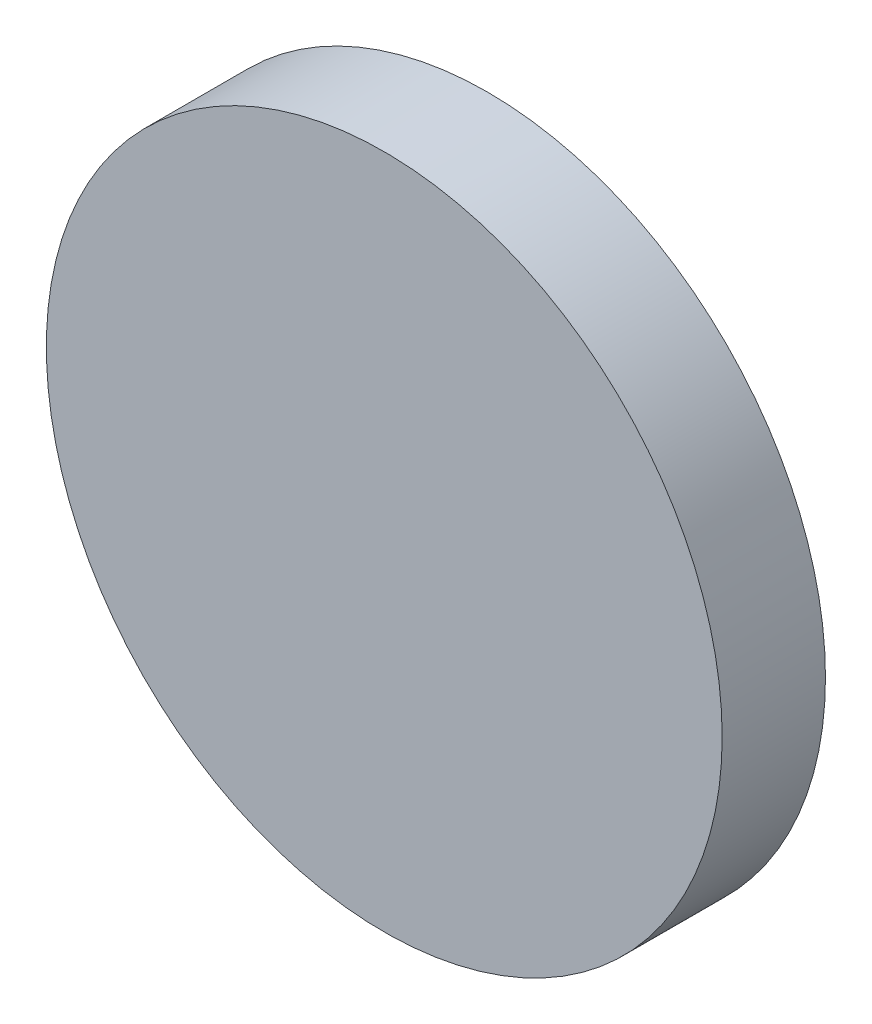
ISO-10303-21;
HEADER;
FILE_DESCRIPTION(('STEP AP214'),'2;1');
FILE_NAME('part.step','',(''),(''),'','','');
FILE_SCHEMA(('AUTOMOTIVE_DESIGN { 1 0 10303 214 1 1 1 1 }'));
ENDSEC;
DATA;
#1=APPLICATION_CONTEXT('core data for automotive mechanical design processes');
#2=APPLICATION_PROTOCOL_DEFINITION('international standard','automotive_design',2000,#1);
#3=PRODUCT_CONTEXT('',#1,'mechanical');
#4=PRODUCT('Part','Part','',(#3));
#5=PRODUCT_RELATED_PRODUCT_CATEGORY('part','',(#4));
#6=PRODUCT_DEFINITION_FORMATION('','',#4);
#7=PRODUCT_DEFINITION_CONTEXT('part definition',#1,'design');
#8=PRODUCT_DEFINITION('design','',#6,#7);
#9=PRODUCT_DEFINITION_SHAPE('','',#8);
#10=(LENGTH_UNIT() NAMED_UNIT(*) SI_UNIT(.MILLI.,.METRE.));
#11=(NAMED_UNIT(*) PLANE_ANGLE_UNIT() SI_UNIT($,.RADIAN.));
#12=(NAMED_UNIT(*) SI_UNIT($,.STERADIAN.) SOLID_ANGLE_UNIT());
#13=UNCERTAINTY_MEASURE_WITH_UNIT(LENGTH_MEASURE(1.E-05),#10,'distance_accuracy_value','');
#14=(GEOMETRIC_REPRESENTATION_CONTEXT(3) GLOBAL_UNCERTAINTY_ASSIGNED_CONTEXT((#13)) GLOBAL_UNIT_ASSIGNED_CONTEXT((#10,
#11,#12)) REPRESENTATION_CONTEXT('',''));
#15=CARTESIAN_POINT('',(0.,0.,0.));
#16=DIRECTION('',(0.,0.,1.));
#17=DIRECTION('',(1.,0.,0.));
#18=AXIS2_PLACEMENT_3D('',#15,#16,#17);
#19=CARTESIAN_POINT('',(0.,26.112,5.));
#20=DIRECTION('',(0.,0.,1.));
#21=DIRECTION('',(1.,0.,0.));
#22=AXIS2_PLACEMENT_3D('',#19,#20,#21);
#23=PLANE('',#22);
#24=CARTESIAN_POINT('',(0.,0.,5.));
#25=DIRECTION('',(0.,0.,1.));
#26=DIRECTION('',(1.,0.,0.));
#27=AXIS2_PLACEMENT_3D('',#24,#25,#26);
#28=CIRCLE('',#27,12.7);
#29=CARTESIAN_POINT('',(12.7,0.,5.));
#30=VERTEX_POINT('',#29);
#31=EDGE_CURVE('E19',#30,#30,#28,.F.);
#32=ORIENTED_EDGE('',*,*,#31,.F.);
#33=EDGE_LOOP('',(#32));
#34=FACE_BOUND('',#33,.T.);
#35=ADVANCED_FACE('F16',(#34),#23,.T.);
#36=CARTESIAN_POINT('',(0.,0.,1.11817791011397));
#37=DIRECTION('',(0.,0.,1.));
#38=DIRECTION('',(1.,0.,0.));
#39=AXIS2_PLACEMENT_3D('',#36,#37,#38);
#40=CYLINDRICAL_SURFACE('',#39,12.7);
#41=ORIENTED_EDGE('',*,*,#31,.T.);
#42=EDGE_LOOP('',(#41));
#43=FACE_BOUND('',#42,.T.);
#44=CARTESIAN_POINT('',(0.,0.,1.11817791011397));
#45=DIRECTION('',(0.,0.,-1.));
#46=DIRECTION('',(-1.,0.,0.));
#47=AXIS2_PLACEMENT_3D('',#44,#45,#46);
#48=CIRCLE('',#47,12.7);
#49=CARTESIAN_POINT('',(-12.7,0.,1.11817791011397));
#50=VERTEX_POINT('',#49);
#51=EDGE_CURVE('E10',#50,#50,#48,.T.);
#52=ORIENTED_EDGE('',*,*,#51,.F.);
#53=EDGE_LOOP('',(#52));
#54=FACE_BOUND('',#53,.T.);
#55=ADVANCED_FACE('F27',(#43,#54),#40,.T.);
#56=CARTESIAN_POINT('',(0.,12.7,1.11817791011397));
#57=CARTESIAN_POINT('',(-12.7,12.7,1.11817791011397));
#58=CARTESIAN_POINT('',(-12.7,0.,1.11817791011397));
#59=CARTESIAN_POINT('',(-12.7,-12.7,1.11817791011397));
#60=CARTESIAN_POINT('',(0.,-12.7,1.11817791011397));
#61=CARTESIAN_POINT('',(12.7,-12.7,1.11817791011397));
#62=CARTESIAN_POINT('',(12.7,0.,1.11817791011397));
#63=CARTESIAN_POINT('',(12.7,12.7,1.11817791011397));
#64=CARTESIAN_POINT('',(0.,12.7,1.11817791011397));
#65=CARTESIAN_POINT('',(0.,11.4702107915972,0.903018483802192));
#66=CARTESIAN_POINT('',(-11.4702107915972,11.4702107915972,0.903018483802192));
#67=CARTESIAN_POINT('',(-11.4702107915972,0.,0.903018483802192));
#68=CARTESIAN_POINT('',(-11.4702107915972,-11.4702107915972,0.903018483802192));
#69=CARTESIAN_POINT('',(0.,-11.4702107915972,0.903018483802192));
#70=CARTESIAN_POINT('',(11.4702107915972,-11.4702107915972,0.903018483802192));
#71=CARTESIAN_POINT('',(11.4702107915972,0.,0.903018483802192));
#72=CARTESIAN_POINT('',(11.4702107915972,11.4702107915972,0.903018483802192));
#73=CARTESIAN_POINT('',(0.,11.4702107915972,0.903018483802192));
#74=CARTESIAN_POINT('',(0.,9.70837581055734,0.638258659520624));
#75=CARTESIAN_POINT('',(-9.70837581055734,9.70837581055734,0.638258659520624));
#76=CARTESIAN_POINT('',(-9.70837581055734,0.,0.638258659520624));
#77=CARTESIAN_POINT('',(-9.70837581055734,-9.70837581055734,0.638258659520624));
#78=CARTESIAN_POINT('',(0.,-9.70837581055734,0.638258659520624));
#79=CARTESIAN_POINT('',(9.70837581055734,-9.70837581055734,0.638258659520624));
#80=CARTESIAN_POINT('',(9.70837581055734,0.,0.638258659520624));
#81=CARTESIAN_POINT('',(9.70837581055734,9.70837581055734,0.638258659520624));
#82=CARTESIAN_POINT('',(0.,9.70837581055734,0.638258659520624));
#83=CARTESIAN_POINT('',(0.,7.23474496276858,0.356526055680388));
#84=CARTESIAN_POINT('',(-7.23474496276858,7.23474496276858,0.356526055680388));
#85=CARTESIAN_POINT('',(-7.23474496276858,0.,0.356526055680388));
#86=CARTESIAN_POINT('',(-7.23474496276858,-7.23474496276858,0.356526055680388));
#87=CARTESIAN_POINT('',(0.,-7.23474496276858,0.356526055680388));
#88=CARTESIAN_POINT('',(7.23474496276858,-7.23474496276858,0.356526055680388));
#89=CARTESIAN_POINT('',(7.23474496276858,0.,0.356526055680388));
#90=CARTESIAN_POINT('',(7.23474496276858,7.23474496276858,0.356526055680388));
#91=CARTESIAN_POINT('',(0.,7.23474496276858,0.356526055680388));
#92=CARTESIAN_POINT('',(0.,5.64611318369411,0.21609899328439));
#93=CARTESIAN_POINT('',(-5.64611318369411,5.64611318369411,0.21609899328439));
#94=CARTESIAN_POINT('',(-5.64611318369411,0.,0.21609899328439));
#95=CARTESIAN_POINT('',(-5.64611318369411,-5.64611318369411,0.21609899328439));
#96=CARTESIAN_POINT('',(0.,-5.64611318369411,0.21609899328439));
#97=CARTESIAN_POINT('',(5.64611318369411,-5.64611318369411,0.21609899328439));
#98=CARTESIAN_POINT('',(5.64611318369411,0.,0.21609899328439));
#99=CARTESIAN_POINT('',(5.64611318369412,5.64611318369411,0.21609899328439));
#100=CARTESIAN_POINT('',(0.,5.64611318369411,0.21609899328439));
#101=CARTESIAN_POINT('',(0.,3.88179187035788,0.0990272864650429));
#102=CARTESIAN_POINT('',(-3.88179187035788,3.88179187035788,0.0990272864650429));
#103=CARTESIAN_POINT('',(-3.88179187035788,0.,0.0990272864650429));
#104=CARTESIAN_POINT('',(-3.88179187035788,-3.88179187035788,0.0990272864650429));
#105=CARTESIAN_POINT('',(0.,-3.88179187035788,0.0990272864650429));
#106=CARTESIAN_POINT('',(3.88179187035788,-3.88179187035788,0.0990272864650429));
#107=CARTESIAN_POINT('',(3.88179187035788,0.,0.0990272864650429));
#108=CARTESIAN_POINT('',(3.88179187035788,3.88179187035788,0.0990272864650429));
#109=CARTESIAN_POINT('',(0.,3.88179187035788,0.0990272864650429));
#110=CARTESIAN_POINT('',(0.,2.11763905440535,0.0208679523992927));
#111=CARTESIAN_POINT('',(-2.11763905440535,2.11763905440535,0.0208679523992927));
#112=CARTESIAN_POINT('',(-2.11763905440535,0.,0.0208679523992927));
#113=CARTESIAN_POINT('',(-2.11763905440535,-2.11763905440535,0.0208679523992927));
#114=CARTESIAN_POINT('',(0.,-2.11763905440535,0.0208679523992927));
#115=CARTESIAN_POINT('',(2.11763905440535,-2.11763905440535,0.0208679523992927));
#116=CARTESIAN_POINT('',(2.11763905440535,0.,0.0208679523992927));
#117=CARTESIAN_POINT('',(2.11763905440535,2.11763905440535,0.0208679523992927));
#118=CARTESIAN_POINT('',(0.,2.11763905440535,0.0208679523992927));
#119=CARTESIAN_POINT('',(0.,0.705685272154695,0.));
#120=CARTESIAN_POINT('',(-0.705685272154695,0.705685272154695,0.));
#121=CARTESIAN_POINT('',(-0.705685272154695,0.,0.));
#122=CARTESIAN_POINT('',(-0.705685272154695,-0.705685272154695,0.));
#123=CARTESIAN_POINT('',(0.,-0.705685272154695,0.));
#124=CARTESIAN_POINT('',(0.705685272154695,-0.705685272154695,0.));
#125=CARTESIAN_POINT('',(0.705685272154695,0.,0.));
#126=CARTESIAN_POINT('',(0.705685272154695,0.705685272154695,0.));
#127=CARTESIAN_POINT('',(0.,0.705685272154695,0.));
#128=CARTESIAN_POINT('',(0.,0.,0.));
#129=CARTESIAN_POINT('',(0.,0.,0.));
#130=CARTESIAN_POINT('',(0.,0.,0.));
#131=CARTESIAN_POINT('',(0.,0.,0.));
#132=CARTESIAN_POINT('',(0.,0.,0.));
#133=CARTESIAN_POINT('',(0.,0.,0.));
#134=CARTESIAN_POINT('',(0.,0.,0.));
#135=CARTESIAN_POINT('',(0.,0.,0.));
#136=CARTESIAN_POINT('',(0.,0.,0.));
#137=(BOUNDED_SURFACE() B_SPLINE_SURFACE(3,2,((#56,#57,#58,#59,#60,#61,#62,#63,#64),(#65,#66,
#67,#68,#69,#70,#71,#72,#73),(#74,#75,#76,#77,#78,#79,#80,#81,#82),(#83,#84,#85,#86,#87,#88,#89,
#90,#91),(#92,#93,#94,#95,#96,#97,#98,#99,#100),(#101,#102,#103,#104,#105,#106,#107,#108,#109),
(#110,#111,#112,#113,#114,#115,#116,#117,#118),(#119,#120,#121,#122,#123,#124,#125,#126,#127),
(#128,#129,#130,#131,#132,#133,#134,#135,#136)),.UNSPECIFIED.,.F.,.T.,
.F.) B_SPLINE_SURFACE_WITH_KNOTS((4,1,1,1,1,1,4),(3,2,2,2,3),(0.,0.293414143465389,
0.418587965573316,0.585062239960894,0.668158939006437,0.834150448041494,1.),(0.,90.,180.,270.,
360.),.UNSPECIFIED.) GEOMETRIC_REPRESENTATION_ITEM() RATIONAL_B_SPLINE_SURFACE(((1.,
0.707106781186548,1.,0.707106781186548,1.,0.707106781186548,1.,0.707106781186548,1.),(1.,
0.707106781186548,1.,0.707106781186548,1.,0.707106781186548,1.,0.707106781186548,1.),(1.,
0.707106781186548,1.,0.707106781186548,1.,0.707106781186548,1.,0.707106781186548,1.),(1.,
0.707106781186548,1.,0.707106781186548,1.,0.707106781186548,1.,0.707106781186548,1.),(1.,
0.707106781186548,1.,0.707106781186548,1.,0.707106781186548,1.,0.707106781186548,1.),(1.,
0.707106781186548,1.,0.707106781186548,1.,0.707106781186548,1.,0.707106781186548,1.),(1.,
0.707106781186548,1.,0.707106781186548,1.,0.707106781186548,1.,0.707106781186548,1.),(1.,
0.707106781186548,1.,0.707106781186548,1.,0.707106781186548,1.,0.707106781186548,1.),(1.,
0.707106781186548,1.,0.707106781186548,1.,0.707106781186548,1.,0.707106781186548,1.))) REPRESENTATION_ITEM('') SURFACE());
#138=ORIENTED_EDGE('',*,*,#51,.T.);
#139=EDGE_LOOP('',(#138));
#140=FACE_BOUND('',#139,.T.);
#141=CARTESIAN_POINT('',(0.,0.,0.));
#142=VERTEX_POINT('',#141);
#143=VERTEX_LOOP('',#142);
#144=FACE_BOUND('',#143,.T.);
#145=ADVANCED_FACE('F25',(#140,#144),#137,.T.);
#146=CLOSED_SHELL('',(#35,#55,#145));
#147=MANIFOLD_SOLID_BREP('B1',#146);
#148=ADVANCED_BREP_SHAPE_REPRESENTATION('',(#18,#147),#14);
#149=SHAPE_DEFINITION_REPRESENTATION(#9,#148);
ENDSEC;
END-ISO-10303-21;
